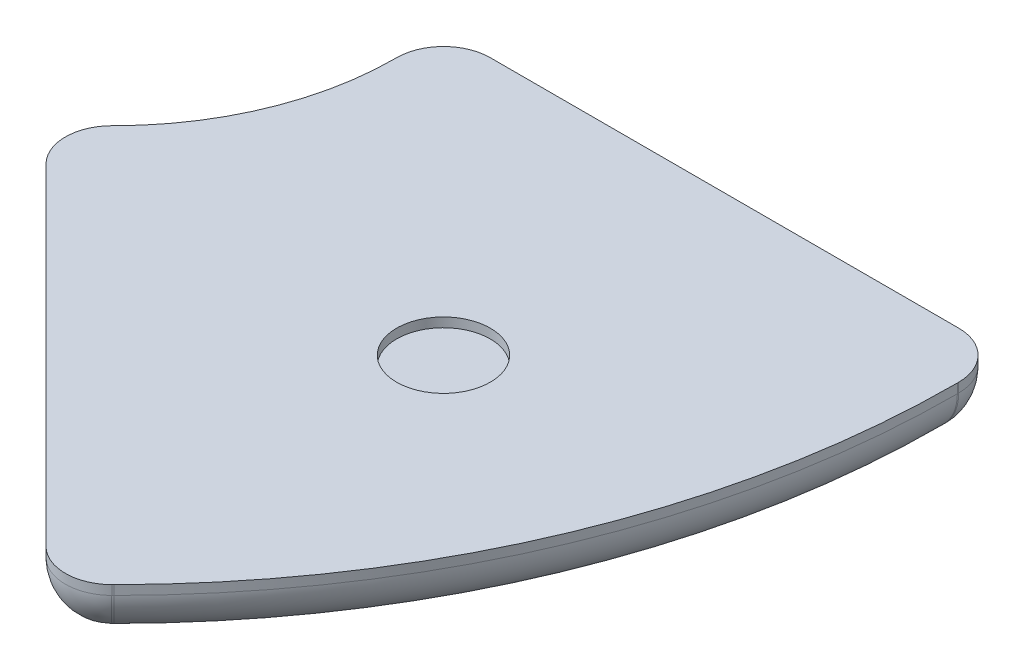
ISO-10303-21;
HEADER;
FILE_DESCRIPTION(('STEP AP214'),'2;1');
FILE_NAME('part.step','',(''),(''),'','','');
FILE_SCHEMA(('AUTOMOTIVE_DESIGN { 1 0 10303 214 1 1 1 1 }'));
ENDSEC;
DATA;
#1=APPLICATION_CONTEXT('core data for automotive mechanical design processes');
#2=APPLICATION_PROTOCOL_DEFINITION('international standard','automotive_design',2000,#1);
#3=PRODUCT_CONTEXT('',#1,'mechanical');
#4=PRODUCT('Part','Part','',(#3));
#5=PRODUCT_RELATED_PRODUCT_CATEGORY('part','',(#4));
#6=PRODUCT_DEFINITION_FORMATION('','',#4);
#7=PRODUCT_DEFINITION_CONTEXT('part definition',#1,'design');
#8=PRODUCT_DEFINITION('design','',#6,#7);
#9=PRODUCT_DEFINITION_SHAPE('','',#8);
#10=(LENGTH_UNIT() NAMED_UNIT(*) SI_UNIT(.MILLI.,.METRE.));
#11=(NAMED_UNIT(*) PLANE_ANGLE_UNIT() SI_UNIT($,.RADIAN.));
#12=(NAMED_UNIT(*) SI_UNIT($,.STERADIAN.) SOLID_ANGLE_UNIT());
#13=UNCERTAINTY_MEASURE_WITH_UNIT(LENGTH_MEASURE(1.E-05),#10,'distance_accuracy_value','');
#14=(GEOMETRIC_REPRESENTATION_CONTEXT(3) GLOBAL_UNCERTAINTY_ASSIGNED_CONTEXT((#13)) GLOBAL_UNIT_ASSIGNED_CONTEXT((#10,
#11,#12)) REPRESENTATION_CONTEXT('',''));
#15=CARTESIAN_POINT('',(0.,0.,0.));
#16=DIRECTION('',(0.,0.,1.));
#17=DIRECTION('',(1.,0.,0.));
#18=AXIS2_PLACEMENT_3D('',#15,#16,#17);
#19=CARTESIAN_POINT('',(15.,-2.875,15.));
#20=DIRECTION('',(0.,-1.,0.));
#21=DIRECTION('',(0.,0.,-1.));
#22=AXIS2_PLACEMENT_3D('',#19,#20,#21);
#23=CYLINDRICAL_SURFACE('',#22,2.5);
#24=CARTESIAN_POINT('',(15.,-2.75,15.));
#25=DIRECTION('',(0.,1.,0.));
#26=DIRECTION('',(1.,0.,0.));
#27=AXIS2_PLACEMENT_3D('',#24,#25,#26);
#28=CIRCLE('',#27,2.5);
#29=CARTESIAN_POINT('',(17.5,-2.75,15.));
#30=VERTEX_POINT('',#29);
#31=EDGE_CURVE('E348',#30,#30,#28,.T.);
#32=ORIENTED_EDGE('',*,*,#31,.F.);
#33=EDGE_LOOP('',(#32));
#34=FACE_BOUND('',#33,.T.);
#35=CARTESIAN_POINT('',(15.,-3.,15.));
#36=DIRECTION('',(0.,-1.,0.));
#37=DIRECTION('',(0.,0.,-1.));
#38=AXIS2_PLACEMENT_3D('',#35,#36,#37);
#39=CIRCLE('',#38,2.5);
#40=CARTESIAN_POINT('',(15.,-3.,12.5));
#41=VERTEX_POINT('',#40);
#42=EDGE_CURVE('E11',#41,#41,#39,.T.);
#43=ORIENTED_EDGE('',*,*,#42,.F.);
#44=EDGE_LOOP('',(#43));
#45=FACE_BOUND('',#44,.T.);
#46=ADVANCED_FACE('F35',(#34,#45),#23,.T.);
#47=CARTESIAN_POINT('',(15.,-3.,15.));
#48=DIRECTION('',(0.,-1.,0.));
#49=DIRECTION('',(0.,0.,-1.));
#50=AXIS2_PLACEMENT_3D('',#47,#48,#49);
#51=PLANE('',#50);
#52=ORIENTED_EDGE('',*,*,#42,.T.);
#53=EDGE_LOOP('',(#52));
#54=FACE_BOUND('',#53,.T.);
#55=ADVANCED_FACE('F423',(#54),#51,.T.);
#56=CARTESIAN_POINT('',(15.,-2.875,15.));
#57=DIRECTION('',(0.,-1.,0.));
#58=DIRECTION('',(0.,0.,-1.));
#59=AXIS2_PLACEMENT_3D('',#56,#57,#58);
#60=CYLINDRICAL_SURFACE('',#59,2.75);
#61=CARTESIAN_POINT('',(15.,-2.75,15.));
#62=DIRECTION('',(0.,1.,0.));
#63=DIRECTION('',(1.,0.,0.));
#64=AXIS2_PLACEMENT_3D('',#61,#62,#63);
#65=CIRCLE('',#64,2.75);
#66=CARTESIAN_POINT('',(17.75,-2.75,15.));
#67=VERTEX_POINT('',#66);
#68=EDGE_CURVE('E45',#67,#67,#65,.T.);
#69=ORIENTED_EDGE('',*,*,#68,.T.);
#70=EDGE_LOOP('',(#69));
#71=FACE_BOUND('',#70,.T.);
#72=CARTESIAN_POINT('',(15.,-3.,15.));
#73=DIRECTION('',(0.,1.,0.));
#74=DIRECTION('',(1.,0.,0.));
#75=AXIS2_PLACEMENT_3D('',#72,#73,#74);
#76=CIRCLE('',#75,2.75);
#77=CARTESIAN_POINT('',(17.75,-3.,15.));
#78=VERTEX_POINT('',#77);
#79=EDGE_CURVE('E219',#78,#78,#76,.T.);
#80=ORIENTED_EDGE('',*,*,#79,.F.);
#81=EDGE_LOOP('',(#80));
#82=FACE_BOUND('',#81,.T.);
#83=ADVANCED_FACE('F429',(#71,#82),#60,.F.);
#84=CARTESIAN_POINT('',(15.,-2.75,15.));
#85=DIRECTION('',(0.,1.,0.));
#86=DIRECTION('',(0.,0.,1.));
#87=AXIS2_PLACEMENT_3D('',#84,#85,#86);
#88=PLANE('',#87);
#89=ORIENTED_EDGE('',*,*,#31,.T.);
#90=EDGE_LOOP('',(#89));
#91=FACE_BOUND('',#90,.T.);
#92=ORIENTED_EDGE('',*,*,#68,.F.);
#93=EDGE_LOOP('',(#92));
#94=FACE_BOUND('',#93,.T.);
#95=ADVANCED_FACE('F439',(#91,#94),#88,.F.);
#96=CARTESIAN_POINT('',(15.0520380470336,-0.499999999999997,32.6256310470336));
#97=DIRECTION('',(-0.707106781186548,0.,0.707106781186548));
#98=DIRECTION('',(0.,1.,0.));
#99=AXIS2_PLACEMENT_3D('',#96,#97,#98);
#100=CYLINDRICAL_SURFACE('',#99,2.5);
#101=CARTESIAN_POINT('',(14.9999997834077,-0.499999999999997,32.6776693106596));
#102=DIRECTION('',(-0.500000000225186,0.707106780868086,0.500000000225186));
#103=DIRECTION('',(-0.499999999774813,-0.707106781505009,0.499999999774814));
#104=AXIS2_PLACEMENT_3D('',#101,#102,#103);
#105=ELLIPSE('',#104,3.53553390434043,2.5);
#106=CARTESIAN_POINT('',(16.7491581084385,-0.526151417004745,34.463851451097));
#107=VERTEX_POINT('',#106);
#108=CARTESIAN_POINT('',(16.7677667363741,-0.499999999999999,34.4454362636259));
#109=VERTEX_POINT('',#108);
#110=EDGE_CURVE('E54',#107,#109,#105,.T.);
#111=ORIENTED_EDGE('',*,*,#110,.F.);
#112=CARTESIAN_POINT('',(14.9999995517773,-0.499999999999997,32.67766954229));
#113=DIRECTION('',(-0.714472679632804,0.,0.699663340513365));
#114=DIRECTION('',(0.699663340513365,0.,0.714472679632804));
#115=AXIS2_PLACEMENT_3D('',#112,#113,#114);
#116=ELLIPSE('',#115,2.50013708410263,2.5);
#117=CARTESIAN_POINT('',(15.,-2.9999999999,32.67767));
#118=VERTEX_POINT('',#117);
#119=EDGE_CURVE('E199',#118,#107,#116,.T.);
#120=ORIENTED_EDGE('',*,*,#119,.F.);
#121=DIRECTION('',(-0.707106781186548,0.,0.707106781186548));
#122=VECTOR('',#121,1.);
#123=CARTESIAN_POINT('',(19.2182254311493,-3.,28.4594436629179));
#124=LINE('',#123,#122);
#125=CARTESIAN_POINT('',(15.0520382004283,-2.9999999999,32.6256313204283));
#126=VERTEX_POINT('',#125);
#127=EDGE_CURVE('E313',#126,#118,#124,.T.);
#128=ORIENTED_EDGE('',*,*,#127,.F.);
#129=CARTESIAN_POINT('',(15.0520382003576,-0.499999999900016,32.6256313203576));
#130=DIRECTION('',(-0.707106781186548,0.,0.707106781186548));
#131=DIRECTION('',(0.,1.,0.));
#132=AXIS2_PLACEMENT_3D('',#129,#130,#131);
#133=CIRCLE('',#132,2.49999999999999);
#134=CARTESIAN_POINT('',(16.8198051533239,-0.5,34.3933982733239));
#135=VERTEX_POINT('',#134);
#136=EDGE_CURVE('E340',#126,#135,#133,.T.);
#137=ORIENTED_EDGE('',*,*,#136,.T.);
#138=DIRECTION('',(0.707106781186572,0.,-0.707106781186523));
#139=VECTOR('',#138,1.);
#140=CARTESIAN_POINT('',(16.79378608,-0.499999999999999,34.41941734));
#141=LINE('',#140,#139);
#142=EDGE_CURVE('E349',#109,#135,#141,.T.);
#143=ORIENTED_EDGE('',*,*,#142,.F.);
#144=EDGE_LOOP('',(#111,#120,#128,#137,#143));
#145=FACE_BOUND('',#144,.T.);
#146=ADVANCED_FACE('F337',(#145),#100,.T.);
#147=CARTESIAN_POINT('',(16.76776695,0.,34.44543647));
#148=DIRECTION('',(0.707106781186523,0.,0.707106781186572));
#149=DIRECTION('',(0.707106781186572,0.,-0.707106781186523));
#150=AXIS2_PLACEMENT_3D('',#147,#148,#149);
#151=PLANE('',#150);
#152=ORIENTED_EDGE('',*,*,#142,.T.);
#153=DIRECTION('',(0.,-1.,0.));
#154=VECTOR('',#153,1.);
#155=CARTESIAN_POINT('',(16.81980514,0.,34.39339828));
#156=LINE('',#155,#154);
#157=CARTESIAN_POINT('',(16.81980514,0.,34.39339828));
#158=VERTEX_POINT('',#157);
#159=EDGE_CURVE('E233',#158,#135,#156,.T.);
#160=ORIENTED_EDGE('',*,*,#159,.F.);
#161=DIRECTION('',(0.707106781186572,0.,-0.707106781186523));
#162=VECTOR('',#161,1.);
#163=CARTESIAN_POINT('',(16.76776695,0.,34.44543647));
#164=LINE('',#163,#162);
#165=CARTESIAN_POINT('',(16.76776695,0.,34.44543647));
#166=VERTEX_POINT('',#165);
#167=EDGE_CURVE('E173',#166,#158,#164,.T.);
#168=ORIENTED_EDGE('',*,*,#167,.F.);
#169=DIRECTION('',(0.,-1.,0.));
#170=VECTOR('',#169,1.);
#171=CARTESIAN_POINT('',(16.76776695,0.,34.44543647));
#172=LINE('',#171,#170);
#173=EDGE_CURVE('E188',#166,#109,#172,.T.);
#174=ORIENTED_EDGE('',*,*,#173,.T.);
#175=EDGE_LOOP('',(#152,#160,#168,#174));
#176=FACE_BOUND('',#175,.T.);
#177=ADVANCED_FACE('F444',(#176),#151,.T.);
#178=CARTESIAN_POINT('',(27.5,-0.499999999999999,2.5));
#179=DIRECTION('',(0.,0.,1.));
#180=DIRECTION('',(1.,0.,0.));
#181=AXIS2_PLACEMENT_3D('',#178,#179,#180);
#182=CYLINDRICAL_SURFACE('',#181,2.5);
#183=CARTESIAN_POINT('',(27.4999999999,-0.499999999900016,2.57359312));
#184=DIRECTION('',(0.,0.,-1.));
#185=DIRECTION('',(0.,-1.,0.));
#186=AXIS2_PLACEMENT_3D('',#183,#184,#185);
#187=CIRCLE('',#186,2.49999999999999);
#188=CARTESIAN_POINT('',(29.9999999999,-0.5,2.57359312));
#189=VERTEX_POINT('',#188);
#190=CARTESIAN_POINT('',(27.5,-2.9999999999,2.57359312));
#191=VERTEX_POINT('',#190);
#192=EDGE_CURVE('E359',#189,#191,#187,.T.);
#193=ORIENTED_EDGE('',*,*,#192,.T.);
#194=DIRECTION('',(0.,0.,1.));
#195=VECTOR('',#194,1.);
#196=CARTESIAN_POINT('',(27.5,-3.,8.42867531638458));
#197=LINE('',#196,#195);
#198=CARTESIAN_POINT('',(27.5,-2.9999999999,2.5));
#199=VERTEX_POINT('',#198);
#200=EDGE_CURVE('E229',#199,#191,#197,.T.);
#201=ORIENTED_EDGE('',*,*,#200,.F.);
#202=CARTESIAN_POINT('',(27.4999999999,-0.4999999999,2.5));
#203=DIRECTION('',(0.,0.,1.));
#204=DIRECTION('',(1.,0.,0.));
#205=AXIS2_PLACEMENT_3D('',#202,#203,#204);
#206=CIRCLE('',#205,2.5);
#207=CARTESIAN_POINT('',(29.9999999999,-0.5,2.5));
#208=VERTEX_POINT('',#207);
#209=EDGE_CURVE('E363',#199,#208,#206,.T.);
#210=ORIENTED_EDGE('',*,*,#209,.T.);
#211=DIRECTION('',(0.,0.,-1.));
#212=VECTOR('',#211,1.);
#213=CARTESIAN_POINT('',(29.99999999,-0.500000000000001,2.536796565));
#214=LINE('',#213,#212);
#215=EDGE_CURVE('E362',#189,#208,#214,.T.);
#216=ORIENTED_EDGE('',*,*,#215,.F.);
#217=EDGE_LOOP('',(#193,#201,#210,#216));
#218=FACE_BOUND('',#217,.T.);
#219=ADVANCED_FACE('F360',(#218),#182,.T.);
#220=CARTESIAN_POINT('',(29.99999999,0.,2.57359313000001));
#221=DIRECTION('',(1.,0.,0.));
#222=DIRECTION('',(0.,0.,-1.));
#223=AXIS2_PLACEMENT_3D('',#220,#221,#222);
#224=PLANE('',#223);
#225=ORIENTED_EDGE('',*,*,#215,.T.);
#226=DIRECTION('',(0.,-1.,0.));
#227=VECTOR('',#226,1.);
#228=CARTESIAN_POINT('',(29.99999999,0.,2.50000001000001));
#229=LINE('',#228,#227);
#230=CARTESIAN_POINT('',(29.99999999,0.,2.50000001000001));
#231=VERTEX_POINT('',#230);
#232=EDGE_CURVE('E195',#231,#208,#229,.T.);
#233=ORIENTED_EDGE('',*,*,#232,.F.);
#234=DIRECTION('',(0.,0.,-1.));
#235=VECTOR('',#234,1.);
#236=CARTESIAN_POINT('',(29.99999999,0.,2.57359313000001));
#237=LINE('',#236,#235);
#238=CARTESIAN_POINT('',(29.99999999,0.,2.57359313000001));
#239=VERTEX_POINT('',#238);
#240=EDGE_CURVE('E249',#239,#231,#237,.T.);
#241=ORIENTED_EDGE('',*,*,#240,.F.);
#242=DIRECTION('',(0.,-1.,0.));
#243=VECTOR('',#242,1.);
#244=CARTESIAN_POINT('',(29.99999999,0.,2.57359313000001));
#245=LINE('',#244,#243);
#246=EDGE_CURVE('E370',#239,#189,#245,.T.);
#247=ORIENTED_EDGE('',*,*,#246,.T.);
#248=EDGE_LOOP('',(#225,#233,#241,#247));
#249=FACE_BOUND('',#248,.T.);
#250=ADVANCED_FACE('F443',(#249),#224,.T.);
#251=CARTESIAN_POINT('',(-2.67763304703363,-0.499999999999998,14.9999669529664));
#252=DIRECTION('',(0.707106781186548,0.,-0.707106781186547));
#253=DIRECTION('',(0.,-1.,0.));
#254=AXIS2_PLACEMENT_3D('',#251,#252,#253);
#255=CYLINDRICAL_SURFACE('',#254,2.5);
#256=CARTESIAN_POINT('',(-2.6256313291647,-0.499999999899994,14.9479617908353));
#257=DIRECTION('',(-0.707106781186548,0.,0.707106781186548));
#258=DIRECTION('',(0.,1.,0.));
#259=AXIS2_PLACEMENT_3D('',#256,#257,#258);
#260=CIRCLE('',#259,2.50000000000001);
#261=CARTESIAN_POINT('',(-4.39339828213107,-0.5,13.1801948378689));
#262=VERTEX_POINT('',#261);
#263=CARTESIAN_POINT('',(-2.62563132923542,-2.9999999999,14.9479617907646));
#264=VERTEX_POINT('',#263);
#265=EDGE_CURVE('E374',#262,#264,#260,.T.);
#266=ORIENTED_EDGE('',*,*,#265,.T.);
#267=DIRECTION('',(0.707106781186548,0.,-0.707106781186547));
#268=VECTOR('',#267,1.);
#269=CARTESIAN_POINT('',(1.51455608708208,-3.,10.8077778188507));
#270=LINE('',#269,#268);
#271=CARTESIAN_POINT('',(-2.67767,-2.9999999999,15.));
#272=VERTEX_POINT('',#271);
#273=EDGE_CURVE('E289',#272,#264,#270,.T.);
#274=ORIENTED_EDGE('',*,*,#273,.F.);
#275=CARTESIAN_POINT('',(-2.67766999992929,-0.4999999999,15.0000000000707));
#276=DIRECTION('',(0.707106781186547,0.,-0.707106781186548));
#277=DIRECTION('',(0.,-1.,0.));
#278=AXIS2_PLACEMENT_3D('',#275,#276,#277);
#279=CIRCLE('',#278,2.5);
#280=CARTESIAN_POINT('',(-4.44543695289566,-0.499999999999999,13.2322330471043));
#281=VERTEX_POINT('',#280);
#282=EDGE_CURVE('E322',#272,#281,#279,.T.);
#283=ORIENTED_EDGE('',*,*,#282,.T.);
#284=DIRECTION('',(-0.707106781186548,0.,0.707106781186548));
#285=VECTOR('',#284,1.);
#286=CARTESIAN_POINT('',(-4.4194,-0.500000000000001,13.20619656));
#287=LINE('',#286,#285);
#288=EDGE_CURVE('E270',#262,#281,#287,.T.);
#289=ORIENTED_EDGE('',*,*,#288,.F.);
#290=EDGE_LOOP('',(#266,#274,#283,#289));
#291=FACE_BOUND('',#290,.T.);
#292=ADVANCED_FACE('F384',(#291),#255,.T.);
#293=CARTESIAN_POINT('',(-4.39339828,0.,13.18019484));
#294=DIRECTION('',(-0.707106781186548,0.,-0.707106781186548));
#295=DIRECTION('',(-0.707106781186548,0.,0.707106781186548));
#296=AXIS2_PLACEMENT_3D('',#293,#294,#295);
#297=PLANE('',#296);
#298=ORIENTED_EDGE('',*,*,#288,.T.);
#299=DIRECTION('',(0.,-1.,0.));
#300=VECTOR('',#299,1.);
#301=CARTESIAN_POINT('',(-4.44543648,0.,13.23223304));
#302=LINE('',#301,#300);
#303=CARTESIAN_POINT('',(-4.44543648,0.,13.23223304));
#304=VERTEX_POINT('',#303);
#305=EDGE_CURVE('E257',#304,#281,#302,.T.);
#306=ORIENTED_EDGE('',*,*,#305,.F.);
#307=DIRECTION('',(-0.707106781186548,0.,0.707106781186548));
#308=VECTOR('',#307,1.);
#309=CARTESIAN_POINT('',(-4.39339828,0.,13.18019484));
#310=LINE('',#309,#308);
#311=CARTESIAN_POINT('',(-4.39339828,0.,13.18019484));
#312=VERTEX_POINT('',#311);
#313=EDGE_CURVE('E172',#312,#304,#310,.T.);
#314=ORIENTED_EDGE('',*,*,#313,.F.);
#315=DIRECTION('',(0.,-1.,0.));
#316=VECTOR('',#315,1.);
#317=CARTESIAN_POINT('',(-4.39339828,0.,13.18019484));
#318=LINE('',#317,#316);
#319=EDGE_CURVE('E268',#312,#262,#318,.T.);
#320=ORIENTED_EDGE('',*,*,#319,.T.);
#321=EDGE_LOOP('',(#298,#306,#314,#320));
#322=FACE_BOUND('',#321,.T.);
#323=ADVANCED_FACE('F380',(#322),#297,.T.);
#324=CARTESIAN_POINT('',(2.5,-0.499999999999999,2.5736));
#325=DIRECTION('',(0.,0.,-1.));
#326=DIRECTION('',(0.,-1.,0.));
#327=AXIS2_PLACEMENT_3D('',#324,#325,#326);
#328=CYLINDRICAL_SURFACE('',#327,2.5);
#329=CARTESIAN_POINT('',(2.50000000010001,-0.499999999899994,2.57359312));
#330=DIRECTION('',(0.,0.,1.));
#331=DIRECTION('',(1.,0.,0.));
#332=AXIS2_PLACEMENT_3D('',#329,#330,#331);
#333=CIRCLE('',#332,2.50000000000001);
#334=CARTESIAN_POINT('',(1.00001784630877E-10,-0.5,2.57359312));
#335=VERTEX_POINT('',#334);
#336=CARTESIAN_POINT('',(2.5,-2.9999999999,2.57359312));
#337=VERTEX_POINT('',#336);
#338=EDGE_CURVE('E201',#335,#337,#333,.T.);
#339=ORIENTED_EDGE('',*,*,#338,.F.);
#340=DIRECTION('',(0.,0.,1.));
#341=VECTOR('',#340,1.);
#342=CARTESIAN_POINT('',(0.,-0.500000000000001,2.5368));
#343=LINE('',#342,#341);
#344=CARTESIAN_POINT('',(1.00000008274037E-10,-0.5,2.5));
#345=VERTEX_POINT('',#344);
#346=EDGE_CURVE('E275',#345,#335,#343,.T.);
#347=ORIENTED_EDGE('',*,*,#346,.F.);
#348=CARTESIAN_POINT('',(2.5000000001,-0.4999999999,2.5));
#349=DIRECTION('',(0.,0.,1.));
#350=DIRECTION('',(1.,0.,0.));
#351=AXIS2_PLACEMENT_3D('',#348,#349,#350);
#352=CIRCLE('',#351,2.5);
#353=CARTESIAN_POINT('',(2.5,-2.9999999999,2.5));
#354=VERTEX_POINT('',#353);
#355=EDGE_CURVE('E271',#345,#354,#352,.T.);
#356=ORIENTED_EDGE('',*,*,#355,.T.);
#357=DIRECTION('',(0.,0.,-1.));
#358=VECTOR('',#357,1.);
#359=CARTESIAN_POINT('',(2.5,-3.,8.46547531638458));
#360=LINE('',#359,#358);
#361=EDGE_CURVE('E228',#337,#354,#360,.T.);
#362=ORIENTED_EDGE('',*,*,#361,.F.);
#363=EDGE_LOOP('',(#339,#347,#356,#362));
#364=FACE_BOUND('',#363,.T.);
#365=ADVANCED_FACE('F393',(#364),#328,.T.);
#366=CARTESIAN_POINT('',(0.,0.,2.5));
#367=DIRECTION('',(-1.,0.,0.));
#368=DIRECTION('',(0.,0.,1.));
#369=AXIS2_PLACEMENT_3D('',#366,#367,#368);
#370=PLANE('',#369);
#371=ORIENTED_EDGE('',*,*,#346,.T.);
#372=DIRECTION('',(0.,-1.,0.));
#373=VECTOR('',#372,1.);
#374=CARTESIAN_POINT('',(0.,0.,2.57359312));
#375=LINE('',#374,#373);
#376=CARTESIAN_POINT('',(0.,0.,2.57359312));
#377=VERTEX_POINT('',#376);
#378=EDGE_CURVE('E282',#377,#335,#375,.T.);
#379=ORIENTED_EDGE('',*,*,#378,.F.);
#380=DIRECTION('',(0.,0.,1.));
#381=VECTOR('',#380,1.);
#382=CARTESIAN_POINT('',(0.,0.,2.5));
#383=LINE('',#382,#381);
#384=CARTESIAN_POINT('',(0.,0.,2.5));
#385=VERTEX_POINT('',#384);
#386=EDGE_CURVE('E260',#385,#377,#383,.T.);
#387=ORIENTED_EDGE('',*,*,#386,.F.);
#388=DIRECTION('',(0.,-1.,0.));
#389=VECTOR('',#388,1.);
#390=CARTESIAN_POINT('',(0.,0.,2.5));
#391=LINE('',#390,#389);
#392=EDGE_CURVE('E274',#385,#345,#391,.T.);
#393=ORIENTED_EDGE('',*,*,#392,.T.);
#394=EDGE_LOOP('',(#371,#379,#387,#393));
#395=FACE_BOUND('',#394,.T.);
#396=ADVANCED_FACE('F397',(#395),#370,.T.);
#397=CARTESIAN_POINT('',(-15.,-0.499999999899994,2.57359312));
#398=DIRECTION('',(0.,-1.,0.));
#399=DIRECTION('',(0.,0.,-1.));
#400=AXIS2_PLACEMENT_3D('',#397,#398,#399);
#401=TOROIDAL_SURFACE('',#400,17.5000000001,2.50000000000001);
#402=CARTESIAN_POINT('',(-15.,-3.,2.57359312));
#403=DIRECTION('',(0.,1.,0.));
#404=DIRECTION('',(1.,0.,0.));
#405=AXIS2_PLACEMENT_3D('',#402,#403,#404);
#406=CIRCLE('',#405,17.5);
#407=EDGE_CURVE('E281',#264,#337,#406,.T.);
#408=ORIENTED_EDGE('',*,*,#407,.F.);
#409=ORIENTED_EDGE('',*,*,#265,.F.);
#410=CARTESIAN_POINT('',(-14.9999999733077,-0.5,2.5735931354599));
#411=DIRECTION('',(0.,-1.,0.));
#412=DIRECTION('',(0.,0.,-1.));
#413=AXIS2_PLACEMENT_3D('',#410,#411,#412);
#414=CIRCLE('',#413,14.9999999733077);
#415=EDGE_CURVE('E283',#335,#262,#414,.T.);
#416=ORIENTED_EDGE('',*,*,#415,.F.);
#417=ORIENTED_EDGE('',*,*,#338,.T.);
#418=EDGE_LOOP('',(#408,#409,#416,#417));
#419=FACE_BOUND('',#418,.T.);
#420=ADVANCED_FACE('F388',(#419),#401,.T.);
#421=CARTESIAN_POINT('',(16.9589022893358,-3.29977837326514,34.6780351567247));
#422=DIRECTION('',(-0.714472679632804,0.,0.699663340513365));
#423=DIRECTION('',(0.699663340513365,0.,0.714472679632804));
#424=AXIS2_PLACEMENT_3D('',#421,#422,#423);
#425=PLANE('',#424);
#426=ORIENTED_EDGE('',*,*,#119,.T.);
#427=DIRECTION('',(0.,-1.,0.));
#428=VECTOR('',#427,1.);
#429=CARTESIAN_POINT('',(16.7491581084385,-1.75,34.463851451097));
#430=LINE('',#429,#428);
#431=CARTESIAN_POINT('',(16.7491583512135,-0.499999999999998,34.4638516990106));
#432=VERTEX_POINT('',#431);
#433=EDGE_CURVE('E204',#432,#107,#430,.T.);
#434=ORIENTED_EDGE('',*,*,#433,.F.);
#435=CARTESIAN_POINT('',(14.99999999993,-0.499999999899998,32.6776699999286));
#436=DIRECTION('',(0.714472679632804,0.,-0.699663340513365));
#437=DIRECTION('',(0.,-1.,0.));
#438=AXIS2_PLACEMENT_3D('',#435,#436,#437);
#439=CIRCLE('',#438,2.5);
#440=EDGE_CURVE('E202',#432,#118,#439,.T.);
#441=ORIENTED_EDGE('',*,*,#440,.T.);
#442=EDGE_LOOP('',(#426,#434,#441));
#443=FACE_BOUND('',#442,.T.);
#444=ADVANCED_FACE('F336',(#443),#425,.T.);
#445=CARTESIAN_POINT('',(12.9996348432753,-3.29977837326514,34.6365722893358));
#446=DIRECTION('',(-0.699663340513365,0.,-0.714472679632804));
#447=DIRECTION('',(-0.714472679632804,0.,0.699663340513365));
#448=AXIS2_PLACEMENT_3D('',#445,#446,#447);
#449=PLANE('',#448);
#450=CARTESIAN_POINT('',(15.0000002455108,-0.499999999999998,32.6776697595781));
#451=DIRECTION('',(-0.699663340513365,0.,-0.714472679632804));
#452=DIRECTION('',(0.714472679632804,0.,-0.699663340513365));
#453=AXIS2_PLACEMENT_3D('',#450,#451,#452);
#454=ELLIPSE('',#453,2.50013708410263,2.5);
#455=CARTESIAN_POINT('',(13.2137206035827,-0.499999999999998,34.4269240235826));
#456=VERTEX_POINT('',#455);
#457=EDGE_CURVE('E295',#118,#456,#454,.T.);
#458=ORIENTED_EDGE('',*,*,#457,.F.);
#459=CARTESIAN_POINT('',(15.0000000000714,-0.499999999899998,32.67766999993));
#460=DIRECTION('',(-0.699663340513365,0.,-0.714472679632804));
#461=DIRECTION('',(-0.714472679632804,0.,0.699663340513365));
#462=AXIS2_PLACEMENT_3D('',#459,#460,#461);
#463=CIRCLE('',#462,2.5);
#464=CARTESIAN_POINT('',(13.2138183009894,-0.499999999999998,34.4268283512135));
#465=VERTEX_POINT('',#464);
#466=EDGE_CURVE('E294',#118,#465,#463,.T.);
#467=ORIENTED_EDGE('',*,*,#466,.T.);
#468=DIRECTION('',(-0.714472679632804,0.,0.699663340513365));
#469=VECTOR('',#468,1.);
#470=CARTESIAN_POINT('',(11.427636601836,-0.499999999999998,36.1759867025668));
#471=LINE('',#470,#469);
#472=EDGE_CURVE('E302',#465,#456,#471,.T.);
#473=ORIENTED_EDGE('',*,*,#472,.T.);
#474=EDGE_LOOP('',(#458,#467,#473));
#475=FACE_BOUND('',#474,.T.);
#476=ADVANCED_FACE('F329',(#475),#449,.F.);
#477=CARTESIAN_POINT('',(17.6237375268901,-0.499999999999998,35.3569425485873));
#478=DIRECTION('',(0.,1.,0.));
#479=DIRECTION('',(0.,0.,1.));
#480=AXIS2_PLACEMENT_3D('',#477,#478,#479);
#481=PLANE('',#480);
#482=DIRECTION('',(0.707106781186548,0.,0.707106781186548));
#483=VECTOR('',#482,1.);
#484=CARTESIAN_POINT('',(-5.32931995801417,-0.499999999999999,15.8838834719858));
#485=LINE('',#484,#483);
#486=CARTESIAN_POINT('',(13.23223304,-0.499999999999999,34.44543647));
#487=VERTEX_POINT('',#486);
#488=EDGE_CURVE('E180',#456,#487,#485,.T.);
#489=ORIENTED_EDGE('',*,*,#488,.F.);
#490=ORIENTED_EDGE('',*,*,#472,.F.);
#491=CARTESIAN_POINT('',(15.,-0.499999999999998,32.67767));
#492=DIRECTION('',(0.,-1.,0.));
#493=DIRECTION('',(0.,0.,-1.));
#494=AXIS2_PLACEMENT_3D('',#491,#492,#493);
#495=CIRCLE('',#494,2.4999999999);
#496=EDGE_CURVE('E298',#487,#465,#495,.T.);
#497=ORIENTED_EDGE('',*,*,#496,.F.);
#498=EDGE_LOOP('',(#489,#490,#497));
#499=FACE_BOUND('',#498,.T.);
#500=ADVANCED_FACE('F331',(#499),#481,.F.);
#501=CARTESIAN_POINT('',(15.,-0.499999999899998,32.67767));
#502=DIRECTION('',(0.,-1.,0.));
#503=DIRECTION('',(0.699663340513364,0.,0.714472679632804));
#504=AXIS2_PLACEMENT_3D('',#501,#502,#503);
#505=SPHERICAL_SURFACE('',#504,2.50000000005);
#506=ORIENTED_EDGE('',*,*,#496,.T.);
#507=ORIENTED_EDGE('',*,*,#466,.F.);
#508=ORIENTED_EDGE('',*,*,#440,.F.);
#509=CARTESIAN_POINT('',(14.999999995,-0.499999999999998,32.6776695222519));
#510=DIRECTION('',(0.,1.,0.));
#511=DIRECTION('',(1.,0.,0.));
#512=AXIS2_PLACEMENT_3D('',#509,#510,#511);
#513=CIRCLE('',#512,2.49999999774815);
#514=EDGE_CURVE('E184',#487,#432,#513,.T.);
#515=ORIENTED_EDGE('',*,*,#514,.F.);
#516=EDGE_LOOP('',(#506,#507,#508,#515));
#517=FACE_BOUND('',#516,.T.);
#518=ADVANCED_FACE('F333',(#517),#505,.T.);
#519=CARTESIAN_POINT('',(-4.44543647806197,-0.499999999999998,13.2322330360053));
#520=DIRECTION('',(0.707106781186548,0.,0.707106781186547));
#521=DIRECTION('',(0.,-1.,0.));
#522=AXIS2_PLACEMENT_3D('',#519,#520,#521);
#523=CYLINDRICAL_SURFACE('',#522,2.5);
#524=ORIENTED_EDGE('',*,*,#457,.T.);
#525=DIRECTION('',(0.707106781186548,0.,0.707106781186548));
#526=VECTOR('',#525,1.);
#527=CARTESIAN_POINT('',(-5.32931995801417,-0.499999999999999,15.8838834719858));
#528=LINE('',#527,#526);
#529=CARTESIAN_POINT('',(-4.44543647862591,-0.500000000000001,16.7677669413741));
#530=VERTEX_POINT('',#529);
#531=EDGE_CURVE('E284',#530,#456,#528,.T.);
#532=ORIENTED_EDGE('',*,*,#531,.F.);
#533=CARTESIAN_POINT('',(-2.67766975703363,-0.499999999999998,14.9999997570336));
#534=DIRECTION('',(0.707106781186548,0.,0.707106781186547));
#535=DIRECTION('',(0.,-1.,0.));
#536=AXIS2_PLACEMENT_3D('',#533,#534,#535);
#537=CIRCLE('',#536,2.5);
#538=EDGE_CURVE('E299',#530,#272,#537,.T.);
#539=ORIENTED_EDGE('',*,*,#538,.T.);
#540=DIRECTION('',(-0.707106781186548,0.,-0.707106781186547));
#541=VECTOR('',#540,1.);
#542=CARTESIAN_POINT('',(0.309328832952487,-3.,17.9869983470197));
#543=LINE('',#542,#541);
#544=EDGE_CURVE('E311',#118,#272,#543,.T.);
#545=ORIENTED_EDGE('',*,*,#544,.F.);
#546=EDGE_LOOP('',(#524,#532,#539,#545));
#547=FACE_BOUND('',#546,.T.);
#548=ADVANCED_FACE('F325',(#547),#523,.T.);
#549=CARTESIAN_POINT('',(-2.67767,-0.4999999999,15.));
#550=DIRECTION('',(0.,-1.,0.));
#551=DIRECTION('',(-0.707106781186547,0.,0.707106781186548));
#552=AXIS2_PLACEMENT_3D('',#549,#550,#551);
#553=SPHERICAL_SURFACE('',#552,2.50000000005);
#554=ORIENTED_EDGE('',*,*,#282,.F.);
#555=ORIENTED_EDGE('',*,*,#538,.F.);
#556=CARTESIAN_POINT('',(-2.67766953225183,-0.499999999999999,14.999999995));
#557=DIRECTION('',(0.,1.,0.));
#558=DIRECTION('',(1.,0.,0.));
#559=AXIS2_PLACEMENT_3D('',#556,#557,#558);
#560=CIRCLE('',#559,2.49999999774817);
#561=EDGE_CURVE('E246',#281,#530,#560,.T.);
#562=ORIENTED_EDGE('',*,*,#561,.F.);
#563=EDGE_LOOP('',(#554,#555,#562));
#564=FACE_BOUND('',#563,.T.);
#565=ADVANCED_FACE('F320',(#564),#553,.T.);
#566=CARTESIAN_POINT('',(27.5,-0.4999999999,2.5));
#567=DIRECTION('',(0.,-1.,0.));
#568=DIRECTION('',(0.,0.,-1.));
#569=AXIS2_PLACEMENT_3D('',#566,#567,#568);
#570=SPHERICAL_SURFACE('',#569,2.50000000005);
#571=ORIENTED_EDGE('',*,*,#209,.F.);
#572=CARTESIAN_POINT('',(27.5,-0.499999999999999,2.5));
#573=DIRECTION('',(1.,0.,0.));
#574=DIRECTION('',(0.,1.,0.));
#575=AXIS2_PLACEMENT_3D('',#572,#573,#574);
#576=CIRCLE('',#575,2.5);
#577=CARTESIAN_POINT('',(27.4999999798722,-0.500000000000001,0.));
#578=VERTEX_POINT('',#577);
#579=EDGE_CURVE('E214',#199,#578,#576,.T.);
#580=ORIENTED_EDGE('',*,*,#579,.T.);
#581=CARTESIAN_POINT('',(27.4999999798722,-0.5,2.50000002012782));
#582=DIRECTION('',(0.,1.,0.));
#583=DIRECTION('',(1.,0.,0.));
#584=AXIS2_PLACEMENT_3D('',#581,#582,#583);
#585=CIRCLE('',#584,2.50000001012782);
#586=EDGE_CURVE('E194',#208,#578,#585,.T.);
#587=ORIENTED_EDGE('',*,*,#586,.F.);
#588=EDGE_LOOP('',(#571,#580,#587));
#589=FACE_BOUND('',#588,.T.);
#590=ADVANCED_FACE('F412',(#589),#570,.T.);
#591=CARTESIAN_POINT('',(2.5,-0.4999999999,2.5));
#592=DIRECTION('',(0.,-1.,0.));
#593=DIRECTION('',(-1.,0.,0.));
#594=AXIS2_PLACEMENT_3D('',#591,#592,#593);
#595=SPHERICAL_SURFACE('',#594,2.50000000005);
#596=CARTESIAN_POINT('',(2.5,-0.499999999999999,2.5));
#597=DIRECTION('',(1.,0.,0.));
#598=DIRECTION('',(0.,1.,0.));
#599=AXIS2_PLACEMENT_3D('',#596,#597,#598);
#600=CIRCLE('',#599,2.5);
#601=CARTESIAN_POINT('',(2.50000001,-0.500000000000001,1.00000062E-08));
#602=VERTEX_POINT('',#601);
#603=EDGE_CURVE('E216',#354,#602,#600,.T.);
#604=ORIENTED_EDGE('',*,*,#603,.F.);
#605=ORIENTED_EDGE('',*,*,#355,.F.);
#606=CARTESIAN_POINT('',(2.50000002012781,-0.5,2.50000002012782));
#607=DIRECTION('',(0.,1.,0.));
#608=DIRECTION('',(1.,0.,0.));
#609=AXIS2_PLACEMENT_3D('',#606,#607,#608);
#610=CIRCLE('',#609,2.50000001012782);
#611=EDGE_CURVE('E220',#602,#345,#610,.T.);
#612=ORIENTED_EDGE('',*,*,#611,.F.);
#613=EDGE_LOOP('',(#604,#605,#612));
#614=FACE_BOUND('',#613,.T.);
#615=ADVANCED_FACE('F410',(#614),#595,.T.);
#616=CARTESIAN_POINT('',(0.,-0.499999999999999,2.5));
#617=DIRECTION('',(1.,0.,0.));
#618=DIRECTION('',(0.,1.,0.));
#619=AXIS2_PLACEMENT_3D('',#616,#617,#618);
#620=CYLINDRICAL_SURFACE('',#619,2.5);
#621=ORIENTED_EDGE('',*,*,#579,.F.);
#622=DIRECTION('',(1.,0.,0.));
#623=VECTOR('',#622,1.);
#624=CARTESIAN_POINT('',(6.72425358461599,-3.,2.5));
#625=LINE('',#624,#623);
#626=EDGE_CURVE('E225',#354,#199,#625,.T.);
#627=ORIENTED_EDGE('',*,*,#626,.F.);
#628=ORIENTED_EDGE('',*,*,#603,.T.);
#629=DIRECTION('',(-1.,0.,0.));
#630=VECTOR('',#629,1.);
#631=CARTESIAN_POINT('',(13.749999995,-0.500000000000001,1.00000061564742E-08));
#632=LINE('',#631,#630);
#633=EDGE_CURVE('E230',#578,#602,#632,.T.);
#634=ORIENTED_EDGE('',*,*,#633,.F.);
#635=EDGE_LOOP('',(#621,#627,#628,#634));
#636=FACE_BOUND('',#635,.T.);
#637=ADVANCED_FACE('F408',(#636),#620,.T.);
#638=CARTESIAN_POINT('',(13.448507169232,-3.,14.3573506327692));
#639=DIRECTION('',(0.,-1.,0.));
#640=DIRECTION('',(0.,0.,-1.));
#641=AXIS2_PLACEMENT_3D('',#638,#639,#640);
#642=PLANE('',#641);
#643=ORIENTED_EDGE('',*,*,#79,.T.);
#644=EDGE_LOOP('',(#643));
#645=FACE_BOUND('',#644,.T.);
#646=ORIENTED_EDGE('',*,*,#127,.T.);
#647=ORIENTED_EDGE('',*,*,#544,.T.);
#648=ORIENTED_EDGE('',*,*,#273,.T.);
#649=ORIENTED_EDGE('',*,*,#407,.T.);
#650=ORIENTED_EDGE('',*,*,#361,.T.);
#651=ORIENTED_EDGE('',*,*,#626,.T.);
#652=ORIENTED_EDGE('',*,*,#200,.T.);
#653=CARTESIAN_POINT('',(-15.,-3.,2.57359312));
#654=DIRECTION('',(0.,-1.,0.));
#655=DIRECTION('',(0.,0.,-1.));
#656=AXIS2_PLACEMENT_3D('',#653,#654,#655);
#657=CIRCLE('',#656,42.5);
#658=EDGE_CURVE('E234',#191,#126,#657,.T.);
#659=ORIENTED_EDGE('',*,*,#658,.T.);
#660=EDGE_LOOP('',(#646,#647,#648,#649,#650,#651,#652,#659));
#661=FACE_BOUND('',#660,.T.);
#662=ADVANCED_FACE('F351',(#645,#661),#642,.T.);
#663=CARTESIAN_POINT('',(-15.,-0.499999999900016,2.57359312));
#664=DIRECTION('',(0.,-1.,0.));
#665=DIRECTION('',(0.,0.,-1.));
#666=AXIS2_PLACEMENT_3D('',#663,#664,#665);
#667=TOROIDAL_SURFACE('',#666,42.4999999999,2.49999999999999);
#668=CARTESIAN_POINT('',(-15.000000042055,-0.5,2.57359310993307));
#669=DIRECTION('',(0.,1.,0.));
#670=DIRECTION('',(1.,0.,0.));
#671=AXIS2_PLACEMENT_3D('',#668,#669,#670);
#672=CIRCLE('',#671,45.000000032055);
#673=EDGE_CURVE('E237',#135,#189,#672,.T.);
#674=ORIENTED_EDGE('',*,*,#673,.F.);
#675=ORIENTED_EDGE('',*,*,#136,.F.);
#676=ORIENTED_EDGE('',*,*,#658,.F.);
#677=ORIENTED_EDGE('',*,*,#192,.F.);
#678=EDGE_LOOP('',(#674,#675,#676,#677));
#679=FACE_BOUND('',#678,.T.);
#680=ADVANCED_FACE('F346',(#679),#667,.T.);
#681=CARTESIAN_POINT('',(-15.000000042055,0.,2.57359310993307));
#682=DIRECTION('',(0.,-1.,0.));
#683=DIRECTION('',(0.,0.,-1.));
#684=AXIS2_PLACEMENT_3D('',#681,#682,#683);
#685=CYLINDRICAL_SURFACE('',#684,45.000000032055);
#686=ORIENTED_EDGE('',*,*,#673,.T.);
#687=ORIENTED_EDGE('',*,*,#246,.F.);
#688=CARTESIAN_POINT('',(-15.000000042055,0.,2.57359310993307));
#689=DIRECTION('',(0.,-1.,0.));
#690=DIRECTION('',(0.,0.,-1.));
#691=AXIS2_PLACEMENT_3D('',#688,#689,#690);
#692=CIRCLE('',#691,45.000000032055);
#693=EDGE_CURVE('E240',#239,#158,#692,.T.);
#694=ORIENTED_EDGE('',*,*,#693,.T.);
#695=ORIENTED_EDGE('',*,*,#159,.T.);
#696=EDGE_LOOP('',(#686,#687,#694,#695));
#697=FACE_BOUND('',#696,.T.);
#698=ADVANCED_FACE('F453',(#697),#685,.T.);
#699=CARTESIAN_POINT('',(27.49999999,0.,1.00000061564742E-08));
#700=DIRECTION('',(0.,0.,-1.));
#701=DIRECTION('',(-1.,0.,0.));
#702=AXIS2_PLACEMENT_3D('',#699,#700,#701);
#703=PLANE('',#702);
#704=ORIENTED_EDGE('',*,*,#633,.T.);
#705=DIRECTION('',(0.,-1.,0.));
#706=VECTOR('',#705,1.);
#707=CARTESIAN_POINT('',(2.50000001,0.,1.00000062E-08));
#708=LINE('',#707,#706);
#709=CARTESIAN_POINT('',(2.50000001,0.,1.00000062E-08));
#710=VERTEX_POINT('',#709);
#711=EDGE_CURVE('E243',#710,#602,#708,.T.);
#712=ORIENTED_EDGE('',*,*,#711,.F.);
#713=DIRECTION('',(-1.,0.,0.));
#714=VECTOR('',#713,1.);
#715=CARTESIAN_POINT('',(27.49999999,0.,1.00000062E-08));
#716=LINE('',#715,#714);
#717=CARTESIAN_POINT('',(27.49999999,0.,1.00000061564742E-08));
#718=VERTEX_POINT('',#717);
#719=EDGE_CURVE('E247',#718,#710,#716,.T.);
#720=ORIENTED_EDGE('',*,*,#719,.F.);
#721=DIRECTION('',(0.,-1.,0.));
#722=VECTOR('',#721,1.);
#723=CARTESIAN_POINT('',(27.49999999,0.,1.00000061564742E-08));
#724=LINE('',#723,#722);
#725=EDGE_CURVE('E223',#718,#578,#724,.T.);
#726=ORIENTED_EDGE('',*,*,#725,.T.);
#727=EDGE_LOOP('',(#704,#712,#720,#726));
#728=FACE_BOUND('',#727,.T.);
#729=ADVANCED_FACE('F405',(#728),#703,.T.);
#730=CARTESIAN_POINT('',(2.50000002012781,0.,2.50000002012782));
#731=DIRECTION('',(0.,-1.,0.));
#732=DIRECTION('',(0.,0.,-1.));
#733=AXIS2_PLACEMENT_3D('',#730,#731,#732);
#734=CYLINDRICAL_SURFACE('',#733,2.50000001012782);
#735=ORIENTED_EDGE('',*,*,#611,.T.);
#736=ORIENTED_EDGE('',*,*,#392,.F.);
#737=CARTESIAN_POINT('',(2.50000002012781,0.,2.50000002012782));
#738=DIRECTION('',(0.,-1.,0.));
#739=DIRECTION('',(0.,0.,-1.));
#740=AXIS2_PLACEMENT_3D('',#737,#738,#739);
#741=CIRCLE('',#740,2.50000001012782);
#742=EDGE_CURVE('E224',#385,#710,#741,.T.);
#743=ORIENTED_EDGE('',*,*,#742,.T.);
#744=ORIENTED_EDGE('',*,*,#711,.T.);
#745=EDGE_LOOP('',(#735,#736,#743,#744));
#746=FACE_BOUND('',#745,.T.);
#747=ADVANCED_FACE('F401',(#746),#734,.T.);
#748=CARTESIAN_POINT('',(-2.67766953225183,0.,14.999999995));
#749=DIRECTION('',(0.,-1.,0.));
#750=DIRECTION('',(0.,0.,-1.));
#751=AXIS2_PLACEMENT_3D('',#748,#749,#750);
#752=CYLINDRICAL_SURFACE('',#751,2.49999999774817);
#753=ORIENTED_EDGE('',*,*,#561,.T.);
#754=DIRECTION('',(0.,-1.,0.));
#755=VECTOR('',#754,1.);
#756=CARTESIAN_POINT('',(-4.44543648,0.,16.76776695));
#757=LINE('',#756,#755);
#758=CARTESIAN_POINT('',(-4.44543648,0.,16.76776695));
#759=VERTEX_POINT('',#758);
#760=EDGE_CURVE('E159',#759,#530,#757,.T.);
#761=ORIENTED_EDGE('',*,*,#760,.F.);
#762=CARTESIAN_POINT('',(-2.67766953225183,0.,14.999999995));
#763=DIRECTION('',(0.,-1.,0.));
#764=DIRECTION('',(0.,0.,-1.));
#765=AXIS2_PLACEMENT_3D('',#762,#763,#764);
#766=CIRCLE('',#765,2.49999999774817);
#767=EDGE_CURVE('E170',#759,#304,#766,.T.);
#768=ORIENTED_EDGE('',*,*,#767,.T.);
#769=ORIENTED_EDGE('',*,*,#305,.T.);
#770=EDGE_LOOP('',(#753,#761,#768,#769));
#771=FACE_BOUND('',#770,.T.);
#772=ADVANCED_FACE('F316',(#771),#752,.T.);
#773=CARTESIAN_POINT('',(-14.9999999733077,0.,2.5735931354599));
#774=DIRECTION('',(0.,-1.,0.));
#775=DIRECTION('',(0.,0.,-1.));
#776=AXIS2_PLACEMENT_3D('',#773,#774,#775);
#777=CYLINDRICAL_SURFACE('',#776,14.9999999733077);
#778=ORIENTED_EDGE('',*,*,#415,.T.);
#779=ORIENTED_EDGE('',*,*,#319,.F.);
#780=CARTESIAN_POINT('',(-14.9999999733077,0.,2.5735931354599));
#781=DIRECTION('',(0.,-1.,0.));
#782=DIRECTION('',(0.,0.,-1.));
#783=AXIS2_PLACEMENT_3D('',#780,#781,#782);
#784=CIRCLE('',#783,14.9999999733077);
#785=EDGE_CURVE('E258',#377,#312,#784,.T.);
#786=ORIENTED_EDGE('',*,*,#785,.F.);
#787=ORIENTED_EDGE('',*,*,#378,.T.);
#788=EDGE_LOOP('',(#778,#779,#786,#787));
#789=FACE_BOUND('',#788,.T.);
#790=ADVANCED_FACE('F461',(#789),#777,.F.);
#791=CARTESIAN_POINT('',(-4.44543648,0.,16.76776695));
#792=DIRECTION('',(-0.707106781186548,0.,0.707106781186547));
#793=DIRECTION('',(0.707106781186547,0.,0.707106781186548));
#794=AXIS2_PLACEMENT_3D('',#791,#792,#793);
#795=PLANE('',#794);
#796=ORIENTED_EDGE('',*,*,#531,.T.);
#797=ORIENTED_EDGE('',*,*,#488,.T.);
#798=DIRECTION('',(0.,-1.,0.));
#799=VECTOR('',#798,1.);
#800=CARTESIAN_POINT('',(13.23223304,0.,34.44543647));
#801=LINE('',#800,#799);
#802=CARTESIAN_POINT('',(13.23223304,0.,34.44543647));
#803=VERTEX_POINT('',#802);
#804=EDGE_CURVE('E177',#803,#487,#801,.T.);
#805=ORIENTED_EDGE('',*,*,#804,.F.);
#806=DIRECTION('',(0.707106781186548,0.,0.707106781186548));
#807=VECTOR('',#806,1.);
#808=CARTESIAN_POINT('',(-4.44543648,0.,16.76776695));
#809=LINE('',#808,#807);
#810=EDGE_CURVE('E165',#759,#803,#809,.T.);
#811=ORIENTED_EDGE('',*,*,#810,.F.);
#812=ORIENTED_EDGE('',*,*,#760,.T.);
#813=EDGE_LOOP('',(#796,#797,#805,#811,#812));
#814=FACE_BOUND('',#813,.T.);
#815=ADVANCED_FACE('F179',(#814),#795,.T.);
#816=CARTESIAN_POINT('',(14.999999995,0.,32.6776695222519));
#817=DIRECTION('',(0.,-1.,0.));
#818=DIRECTION('',(0.,0.,-1.));
#819=AXIS2_PLACEMENT_3D('',#816,#817,#818);
#820=CYLINDRICAL_SURFACE('',#819,2.49999999774815);
#821=ORIENTED_EDGE('',*,*,#110,.T.);
#822=ORIENTED_EDGE('',*,*,#173,.F.);
#823=CARTESIAN_POINT('',(14.999999995,0.,32.6776695222519));
#824=DIRECTION('',(0.,-1.,0.));
#825=DIRECTION('',(0.,0.,-1.));
#826=AXIS2_PLACEMENT_3D('',#823,#824,#825);
#827=CIRCLE('',#826,2.49999999774815);
#828=EDGE_CURVE('E169',#166,#803,#827,.T.);
#829=ORIENTED_EDGE('',*,*,#828,.T.);
#830=ORIENTED_EDGE('',*,*,#804,.T.);
#831=ORIENTED_EDGE('',*,*,#514,.T.);
#832=ORIENTED_EDGE('',*,*,#433,.T.);
#833=EDGE_LOOP('',(#821,#822,#829,#830,#831,#832));
#834=FACE_BOUND('',#833,.T.);
#835=ADVANCED_FACE('F37',(#834),#820,.T.);
#836=CARTESIAN_POINT('',(27.4999999798722,0.,2.50000002012782));
#837=DIRECTION('',(0.,-1.,0.));
#838=DIRECTION('',(0.,0.,-1.));
#839=AXIS2_PLACEMENT_3D('',#836,#837,#838);
#840=CYLINDRICAL_SURFACE('',#839,2.50000001012782);
#841=ORIENTED_EDGE('',*,*,#586,.T.);
#842=ORIENTED_EDGE('',*,*,#725,.F.);
#843=CARTESIAN_POINT('',(27.4999999798722,0.,2.50000002012782));
#844=DIRECTION('',(0.,-1.,0.));
#845=DIRECTION('',(0.,0.,-1.));
#846=AXIS2_PLACEMENT_3D('',#843,#844,#845);
#847=CIRCLE('',#846,2.50000001012782);
#848=EDGE_CURVE('E192',#718,#231,#847,.T.);
#849=ORIENTED_EDGE('',*,*,#848,.T.);
#850=ORIENTED_EDGE('',*,*,#232,.T.);
#851=EDGE_LOOP('',(#841,#842,#849,#850));
#852=FACE_BOUND('',#851,.T.);
#853=ADVANCED_FACE('F464',(#852),#840,.T.);
#854=CARTESIAN_POINT('',(13.448507169232,0.,14.3573506327692));
#855=DIRECTION('',(0.,-1.,0.));
#856=DIRECTION('',(0.,0.,-1.));
#857=AXIS2_PLACEMENT_3D('',#854,#855,#856);
#858=PLANE('',#857);
#859=CARTESIAN_POINT('',(15.,0.,15.));
#860=DIRECTION('',(0.,1.,0.));
#861=DIRECTION('',(0.,0.,1.));
#862=AXIS2_PLACEMENT_3D('',#859,#860,#861);
#863=CIRCLE('',#862,2.5);
#864=CARTESIAN_POINT('',(15.,0.,17.5));
#865=VERTEX_POINT('',#864);
#866=EDGE_CURVE('E637',#865,#865,#863,.T.);
#867=ORIENTED_EDGE('',*,*,#866,.F.);
#868=EDGE_LOOP('',(#867));
#869=FACE_BOUND('',#868,.T.);
#870=ORIENTED_EDGE('',*,*,#386,.T.);
#871=ORIENTED_EDGE('',*,*,#785,.T.);
#872=ORIENTED_EDGE('',*,*,#313,.T.);
#873=ORIENTED_EDGE('',*,*,#767,.F.);
#874=ORIENTED_EDGE('',*,*,#810,.T.);
#875=ORIENTED_EDGE('',*,*,#828,.F.);
#876=ORIENTED_EDGE('',*,*,#167,.T.);
#877=ORIENTED_EDGE('',*,*,#693,.F.);
#878=ORIENTED_EDGE('',*,*,#240,.T.);
#879=ORIENTED_EDGE('',*,*,#848,.F.);
#880=ORIENTED_EDGE('',*,*,#719,.T.);
#881=ORIENTED_EDGE('',*,*,#742,.F.);
#882=EDGE_LOOP('',(#870,#871,#872,#873,#874,#875,#876,#877,#878,#879,#880,#881));
#883=FACE_BOUND('',#882,.T.);
#884=ADVANCED_FACE('F167',(#869,#883),#858,.F.);
#885=CARTESIAN_POINT('',(15.,-0.5,15.));
#886=DIRECTION('',(0.,1.,0.));
#887=DIRECTION('',(0.,0.,1.));
#888=AXIS2_PLACEMENT_3D('',#885,#886,#887);
#889=CYLINDRICAL_SURFACE('',#888,2.5);
#890=CARTESIAN_POINT('',(15.,-0.5,15.));
#891=DIRECTION('',(0.,1.,0.));
#892=DIRECTION('',(0.,0.,1.));
#893=AXIS2_PLACEMENT_3D('',#890,#891,#892);
#894=CIRCLE('',#893,2.5);
#895=CARTESIAN_POINT('',(15.,-0.5,17.5));
#896=VERTEX_POINT('',#895);
#897=EDGE_CURVE('E250',#896,#896,#894,.T.);
#898=ORIENTED_EDGE('',*,*,#897,.F.);
#899=EDGE_LOOP('',(#898));
#900=FACE_BOUND('',#899,.T.);
#901=ORIENTED_EDGE('',*,*,#866,.T.);
#902=EDGE_LOOP('',(#901));
#903=FACE_BOUND('',#902,.T.);
#904=ADVANCED_FACE('F470',(#900,#903),#889,.F.);
#905=CARTESIAN_POINT('',(15.,-0.5,15.));
#906=DIRECTION('',(0.,1.,0.));
#907=DIRECTION('',(0.,0.,1.));
#908=AXIS2_PLACEMENT_3D('',#905,#906,#907);
#909=PLANE('',#908);
#910=ORIENTED_EDGE('',*,*,#897,.T.);
#911=EDGE_LOOP('',(#910));
#912=FACE_BOUND('',#911,.T.);
#913=ADVANCED_FACE('F611',(#912),#909,.T.);
#914=CLOSED_SHELL('',(#46,#55,#83,#95,#146,#177,#219,#250,#292,#323,#365,#396,#420,#444,#476,
#500,#518,#548,#565,#590,#615,#637,#662,#680,#698,#729,#747,#772,#790,#815,#835,#853,#884,#904,#913));
#915=MANIFOLD_SOLID_BREP('B2',#914);
#916=ADVANCED_BREP_SHAPE_REPRESENTATION('',(#18,#915),#14);
#917=SHAPE_DEFINITION_REPRESENTATION(#9,#916);
ENDSEC;
END-ISO-10303-21;
